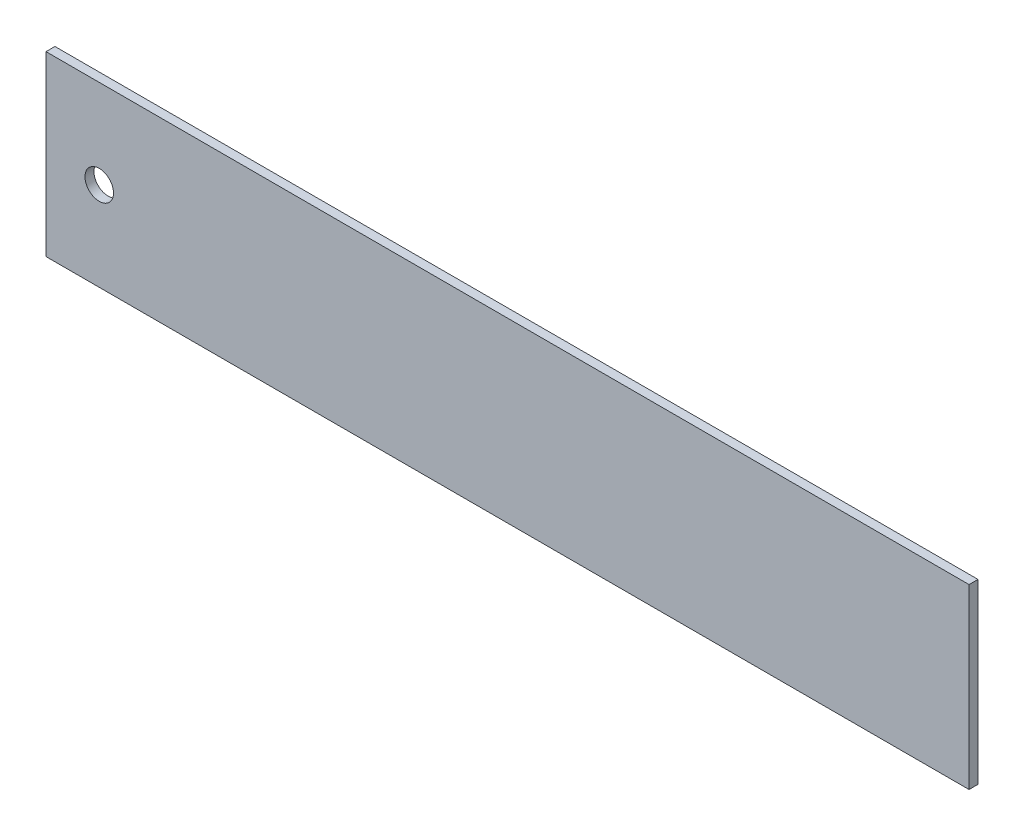
ISO-10303-21;
HEADER;
FILE_DESCRIPTION(('STEP AP214'),'2;1');
FILE_NAME('part.step','',(''),(''),'','','');
FILE_SCHEMA(('AUTOMOTIVE_DESIGN { 1 0 10303 214 1 1 1 1 }'));
ENDSEC;
DATA;
#1=APPLICATION_CONTEXT('core data for automotive mechanical design processes');
#2=APPLICATION_PROTOCOL_DEFINITION('international standard','automotive_design',2000,#1);
#3=PRODUCT_CONTEXT('',#1,'mechanical');
#4=PRODUCT('Part','Part','',(#3));
#5=PRODUCT_RELATED_PRODUCT_CATEGORY('part','',(#4));
#6=PRODUCT_DEFINITION_FORMATION('','',#4);
#7=PRODUCT_DEFINITION_CONTEXT('part definition',#1,'design');
#8=PRODUCT_DEFINITION('design','',#6,#7);
#9=PRODUCT_DEFINITION_SHAPE('','',#8);
#10=(LENGTH_UNIT() NAMED_UNIT(*) SI_UNIT(.MILLI.,.METRE.));
#11=(NAMED_UNIT(*) PLANE_ANGLE_UNIT() SI_UNIT($,.RADIAN.));
#12=(NAMED_UNIT(*) SI_UNIT($,.STERADIAN.) SOLID_ANGLE_UNIT());
#13=UNCERTAINTY_MEASURE_WITH_UNIT(LENGTH_MEASURE(1.E-05),#10,'distance_accuracy_value','');
#14=(GEOMETRIC_REPRESENTATION_CONTEXT(3) GLOBAL_UNCERTAINTY_ASSIGNED_CONTEXT((#13)) GLOBAL_UNIT_ASSIGNED_CONTEXT((#10,
#11,#12)) REPRESENTATION_CONTEXT('',''));
#15=CARTESIAN_POINT('',(0.,0.,0.));
#16=DIRECTION('',(0.,0.,1.));
#17=DIRECTION('',(1.,0.,0.));
#18=AXIS2_PLACEMENT_3D('',#15,#16,#17);
#19=CARTESIAN_POINT('',(82.55,15.875,1.6002));
#20=DIRECTION('',(-1.,0.,0.));
#21=DIRECTION('',(0.,0.,1.));
#22=AXIS2_PLACEMENT_3D('',#19,#20,#21);
#23=PLANE('',#22);
#24=DIRECTION('',(0.,1.,0.));
#25=VECTOR('',#24,1.);
#26=CARTESIAN_POINT('',(82.55,15.875,0.));
#27=LINE('',#26,#25);
#28=CARTESIAN_POINT('',(82.55,-15.875,0.));
#29=VERTEX_POINT('',#28);
#30=CARTESIAN_POINT('',(82.55,15.875,0.));
#31=VERTEX_POINT('',#30);
#32=EDGE_CURVE('E102',#29,#31,#27,.T.);
#33=ORIENTED_EDGE('',*,*,#32,.T.);
#34=DIRECTION('',(0.,0.,-1.));
#35=VECTOR('',#34,1.);
#36=CARTESIAN_POINT('',(82.55,15.875,1.6002));
#37=LINE('',#36,#35);
#38=CARTESIAN_POINT('',(82.55,15.875,1.6002));
#39=VERTEX_POINT('',#38);
#40=EDGE_CURVE('E11',#39,#31,#37,.T.);
#41=ORIENTED_EDGE('',*,*,#40,.F.);
#42=DIRECTION('',(0.,1.,0.));
#43=VECTOR('',#42,1.);
#44=CARTESIAN_POINT('',(82.55,15.875,1.6002));
#45=LINE('',#44,#43);
#46=CARTESIAN_POINT('',(82.55,-15.875,1.6002));
#47=VERTEX_POINT('',#46);
#48=EDGE_CURVE('E90',#47,#39,#45,.T.);
#49=ORIENTED_EDGE('',*,*,#48,.F.);
#50=DIRECTION('',(0.,0.,-1.));
#51=VECTOR('',#50,1.);
#52=CARTESIAN_POINT('',(82.55,-15.875,1.6002));
#53=LINE('',#52,#51);
#54=EDGE_CURVE('E98',#47,#29,#53,.T.);
#55=ORIENTED_EDGE('',*,*,#54,.T.);
#56=EDGE_LOOP('',(#33,#41,#49,#55));
#57=FACE_BOUND('',#56,.T.);
#58=ADVANCED_FACE('F39',(#57),#23,.F.);
#59=CARTESIAN_POINT('',(-82.55,15.875,1.6002));
#60=DIRECTION('',(0.,-1.,0.));
#61=DIRECTION('',(0.,0.,-1.));
#62=AXIS2_PLACEMENT_3D('',#59,#60,#61);
#63=PLANE('',#62);
#64=DIRECTION('',(-1.,0.,0.));
#65=VECTOR('',#64,1.);
#66=CARTESIAN_POINT('',(-82.55,15.875,0.));
#67=LINE('',#66,#65);
#68=CARTESIAN_POINT('',(-82.55,15.875,0.));
#69=VERTEX_POINT('',#68);
#70=EDGE_CURVE('E94',#31,#69,#67,.T.);
#71=ORIENTED_EDGE('',*,*,#70,.T.);
#72=DIRECTION('',(0.,0.,-1.));
#73=VECTOR('',#72,1.);
#74=CARTESIAN_POINT('',(-82.55,15.875,1.6002));
#75=LINE('',#74,#73);
#76=CARTESIAN_POINT('',(-82.55,15.875,1.6002));
#77=VERTEX_POINT('',#76);
#78=EDGE_CURVE('E47',#77,#69,#75,.T.);
#79=ORIENTED_EDGE('',*,*,#78,.F.);
#80=DIRECTION('',(-1.,0.,0.));
#81=VECTOR('',#80,1.);
#82=CARTESIAN_POINT('',(-82.55,15.875,1.6002));
#83=LINE('',#82,#81);
#84=EDGE_CURVE('E85',#39,#77,#83,.T.);
#85=ORIENTED_EDGE('',*,*,#84,.F.);
#86=ORIENTED_EDGE('',*,*,#40,.T.);
#87=EDGE_LOOP('',(#71,#79,#85,#86));
#88=FACE_BOUND('',#87,.T.);
#89=ADVANCED_FACE('F93',(#88),#63,.F.);
#90=CARTESIAN_POINT('',(-82.55,15.875,1.6002));
#91=DIRECTION('',(1.,0.,0.));
#92=DIRECTION('',(0.,0.,-1.));
#93=AXIS2_PLACEMENT_3D('',#90,#91,#92);
#94=PLANE('',#93);
#95=DIRECTION('',(0.,-1.,0.));
#96=VECTOR('',#95,1.);
#97=CARTESIAN_POINT('',(-82.55,15.875,0.));
#98=LINE('',#97,#96);
#99=CARTESIAN_POINT('',(-82.55,-15.875,0.));
#100=VERTEX_POINT('',#99);
#101=EDGE_CURVE('E72',#69,#100,#98,.T.);
#102=ORIENTED_EDGE('',*,*,#101,.T.);
#103=DIRECTION('',(0.,0.,-1.));
#104=VECTOR('',#103,1.);
#105=CARTESIAN_POINT('',(-82.55,-15.875,1.6002));
#106=LINE('',#105,#104);
#107=CARTESIAN_POINT('',(-82.55,-15.875,1.6002));
#108=VERTEX_POINT('',#107);
#109=EDGE_CURVE('E95',#108,#100,#106,.T.);
#110=ORIENTED_EDGE('',*,*,#109,.F.);
#111=DIRECTION('',(0.,-1.,0.));
#112=VECTOR('',#111,1.);
#113=CARTESIAN_POINT('',(-82.55,15.875,1.6002));
#114=LINE('',#113,#112);
#115=EDGE_CURVE('E88',#77,#108,#114,.T.);
#116=ORIENTED_EDGE('',*,*,#115,.F.);
#117=ORIENTED_EDGE('',*,*,#78,.T.);
#118=EDGE_LOOP('',(#102,#110,#116,#117));
#119=FACE_BOUND('',#118,.T.);
#120=ADVANCED_FACE('F96',(#119),#94,.F.);
#121=CARTESIAN_POINT('',(-82.55,-15.875,1.6002));
#122=DIRECTION('',(0.,1.,0.));
#123=DIRECTION('',(0.,0.,1.));
#124=AXIS2_PLACEMENT_3D('',#121,#122,#123);
#125=PLANE('',#124);
#126=DIRECTION('',(1.,0.,0.));
#127=VECTOR('',#126,1.);
#128=CARTESIAN_POINT('',(-82.55,-15.875,0.));
#129=LINE('',#128,#127);
#130=EDGE_CURVE('E78',#100,#29,#129,.T.);
#131=ORIENTED_EDGE('',*,*,#130,.T.);
#132=ORIENTED_EDGE('',*,*,#54,.F.);
#133=DIRECTION('',(1.,0.,0.));
#134=VECTOR('',#133,1.);
#135=CARTESIAN_POINT('',(-82.55,-15.875,1.6002));
#136=LINE('',#135,#134);
#137=EDGE_CURVE('E55',#108,#47,#136,.T.);
#138=ORIENTED_EDGE('',*,*,#137,.F.);
#139=ORIENTED_EDGE('',*,*,#109,.T.);
#140=EDGE_LOOP('',(#131,#132,#138,#139));
#141=FACE_BOUND('',#140,.T.);
#142=ADVANCED_FACE('F110',(#141),#125,.F.);
#143=CARTESIAN_POINT('',(0.,0.,1.6002));
#144=DIRECTION('',(0.,0.,1.));
#145=DIRECTION('',(1.,0.,0.));
#146=AXIS2_PLACEMENT_3D('',#143,#144,#145);
#147=PLANE('',#146);
#148=CARTESIAN_POINT('',(-73.025,0.,1.6002));
#149=DIRECTION('',(0.,0.,1.));
#150=DIRECTION('',(1.,0.,0.));
#151=AXIS2_PLACEMENT_3D('',#148,#149,#150);
#152=CIRCLE('',#151,2.55270000000001);
#153=CARTESIAN_POINT('',(-70.4723,0.,1.6002));
#154=VERTEX_POINT('',#153);
#155=EDGE_CURVE('E105',#154,#154,#152,.T.);
#156=ORIENTED_EDGE('',*,*,#155,.F.);
#157=EDGE_LOOP('',(#156));
#158=FACE_BOUND('',#157,.T.);
#159=ORIENTED_EDGE('',*,*,#48,.T.);
#160=ORIENTED_EDGE('',*,*,#84,.T.);
#161=ORIENTED_EDGE('',*,*,#115,.T.);
#162=ORIENTED_EDGE('',*,*,#137,.T.);
#163=EDGE_LOOP('',(#159,#160,#161,#162));
#164=FACE_BOUND('',#163,.T.);
#165=ADVANCED_FACE('F86',(#158,#164),#147,.T.);
#166=CARTESIAN_POINT('',(0.,0.,0.));
#167=DIRECTION('',(0.,0.,1.));
#168=DIRECTION('',(1.,0.,0.));
#169=AXIS2_PLACEMENT_3D('',#166,#167,#168);
#170=PLANE('',#169);
#171=CARTESIAN_POINT('',(-73.025,0.,0.));
#172=DIRECTION('',(0.,0.,-1.));
#173=DIRECTION('',(-1.,0.,0.));
#174=AXIS2_PLACEMENT_3D('',#171,#172,#173);
#175=CIRCLE('',#174,2.55270000000001);
#176=CARTESIAN_POINT('',(-75.5777,0.,0.));
#177=VERTEX_POINT('',#176);
#178=EDGE_CURVE('E118',#177,#177,#175,.T.);
#179=ORIENTED_EDGE('',*,*,#178,.F.);
#180=EDGE_LOOP('',(#179));
#181=FACE_BOUND('',#180,.T.);
#182=ORIENTED_EDGE('',*,*,#32,.F.);
#183=ORIENTED_EDGE('',*,*,#130,.F.);
#184=ORIENTED_EDGE('',*,*,#101,.F.);
#185=ORIENTED_EDGE('',*,*,#70,.F.);
#186=EDGE_LOOP('',(#182,#183,#184,#185));
#187=FACE_BOUND('',#186,.T.);
#188=ADVANCED_FACE('F113',(#181,#187),#170,.F.);
#189=CARTESIAN_POINT('',(-73.025,0.,2.54));
#190=DIRECTION('',(0.,0.,-1.));
#191=DIRECTION('',(-1.,0.,0.));
#192=AXIS2_PLACEMENT_3D('',#189,#190,#191);
#193=CYLINDRICAL_SURFACE('',#192,2.55270000000001);
#194=ORIENTED_EDGE('',*,*,#155,.T.);
#195=EDGE_LOOP('',(#194));
#196=FACE_BOUND('',#195,.T.);
#197=ORIENTED_EDGE('',*,*,#178,.T.);
#198=EDGE_LOOP('',(#197));
#199=FACE_BOUND('',#198,.T.);
#200=ADVANCED_FACE('F122',(#196,#199),#193,.F.);
#201=CLOSED_SHELL('',(#58,#89,#120,#142,#165,#188,#200));
#202=MANIFOLD_SOLID_BREP('B2',#201);
#203=ADVANCED_BREP_SHAPE_REPRESENTATION('',(#18,#202),#14);
#204=SHAPE_DEFINITION_REPRESENTATION(#9,#203);
ENDSEC;
END-ISO-10303-21;
